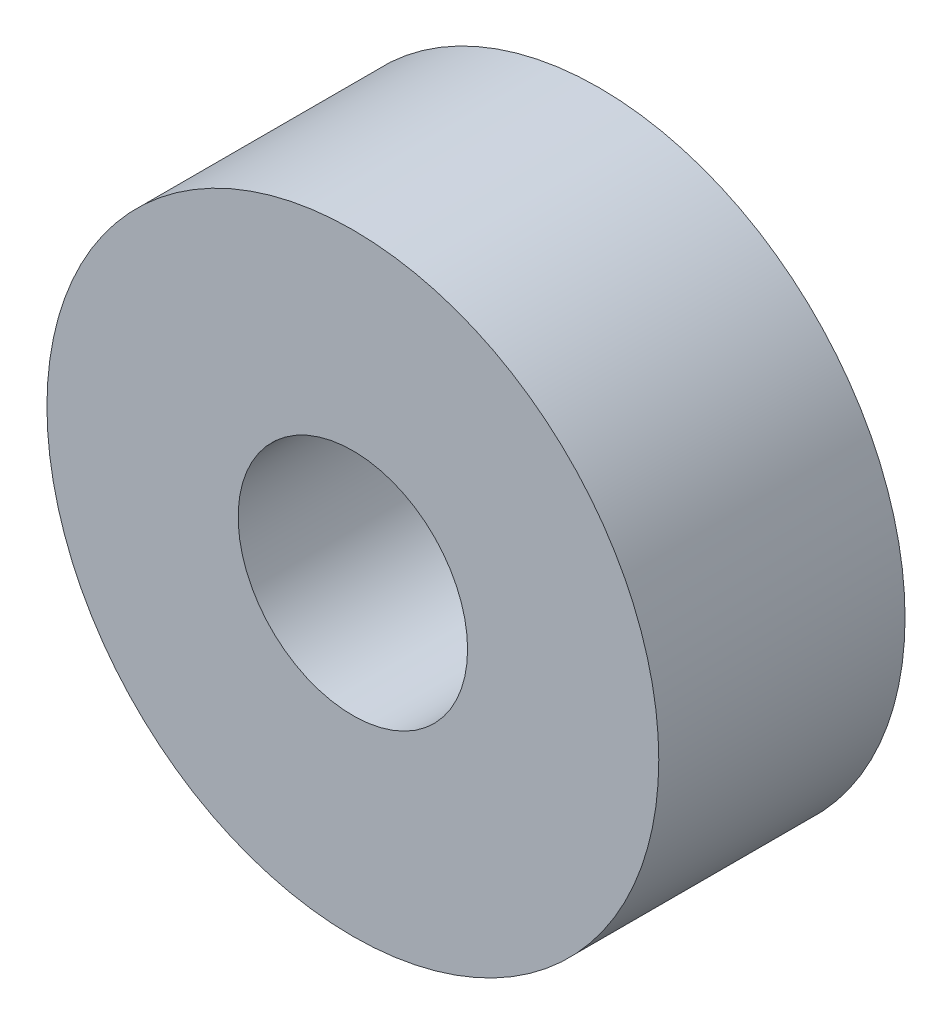
ISO-10303-21;
HEADER;
FILE_DESCRIPTION(('STEP AP214'),'2;1');
FILE_NAME('part.step','',(''),(''),'','','');
FILE_SCHEMA(('AUTOMOTIVE_DESIGN { 1 0 10303 214 1 1 1 1 }'));
ENDSEC;
DATA;
#1=APPLICATION_CONTEXT('core data for automotive mechanical design processes');
#2=APPLICATION_PROTOCOL_DEFINITION('international standard','automotive_design',2000,#1);
#3=PRODUCT_CONTEXT('',#1,'mechanical');
#4=PRODUCT('Part','Part','',(#3));
#5=PRODUCT_RELATED_PRODUCT_CATEGORY('part','',(#4));
#6=PRODUCT_DEFINITION_FORMATION('','',#4);
#7=PRODUCT_DEFINITION_CONTEXT('part definition',#1,'design');
#8=PRODUCT_DEFINITION('design','',#6,#7);
#9=PRODUCT_DEFINITION_SHAPE('','',#8);
#10=(LENGTH_UNIT() NAMED_UNIT(*) SI_UNIT(.MILLI.,.METRE.));
#11=(NAMED_UNIT(*) PLANE_ANGLE_UNIT() SI_UNIT($,.RADIAN.));
#12=(NAMED_UNIT(*) SI_UNIT($,.STERADIAN.) SOLID_ANGLE_UNIT());
#13=UNCERTAINTY_MEASURE_WITH_UNIT(LENGTH_MEASURE(1.E-05),#10,'distance_accuracy_value','');
#14=(GEOMETRIC_REPRESENTATION_CONTEXT(3) GLOBAL_UNCERTAINTY_ASSIGNED_CONTEXT((#13)) GLOBAL_UNIT_ASSIGNED_CONTEXT((#10,
#11,#12)) REPRESENTATION_CONTEXT('',''));
#15=CARTESIAN_POINT('',(0.,0.,0.));
#16=DIRECTION('',(0.,0.,1.));
#17=DIRECTION('',(1.,0.,0.));
#18=AXIS2_PLACEMENT_3D('',#15,#16,#17);
#19=CARTESIAN_POINT('',(0.,0.,1.61));
#20=DIRECTION('',(0.,0.,1.));
#21=DIRECTION('',(1.,0.,0.));
#22=AXIS2_PLACEMENT_3D('',#19,#20,#21);
#23=PLANE('',#22);
#24=CARTESIAN_POINT('',(0.,0.,1.61));
#25=DIRECTION('',(0.,0.,1.));
#26=DIRECTION('',(1.,0.,0.));
#27=AXIS2_PLACEMENT_3D('',#24,#25,#26);
#28=CIRCLE('',#27,4.);
#29=CARTESIAN_POINT('',(4.,0.,1.61));
#30=VERTEX_POINT('',#29);
#31=EDGE_CURVE('E10',#30,#30,#28,.T.);
#32=ORIENTED_EDGE('',*,*,#31,.T.);
#33=EDGE_LOOP('',(#32));
#34=FACE_BOUND('',#33,.T.);
#35=CARTESIAN_POINT('',(0.,0.,1.61));
#36=DIRECTION('',(0.,0.,1.));
#37=DIRECTION('',(1.,0.,0.));
#38=AXIS2_PLACEMENT_3D('',#35,#36,#37);
#39=CIRCLE('',#38,1.5);
#40=CARTESIAN_POINT('',(1.5,0.,1.61));
#41=VERTEX_POINT('',#40);
#42=EDGE_CURVE('E56',#41,#41,#39,.T.);
#43=ORIENTED_EDGE('',*,*,#42,.F.);
#44=EDGE_LOOP('',(#43));
#45=FACE_BOUND('',#44,.T.);
#46=ADVANCED_FACE('F43',(#34,#45),#23,.T.);
#47=CARTESIAN_POINT('',(0.,0.,-1.61));
#48=DIRECTION('',(0.,0.,1.));
#49=DIRECTION('',(1.,0.,0.));
#50=AXIS2_PLACEMENT_3D('',#47,#48,#49);
#51=PLANE('',#50);
#52=CARTESIAN_POINT('',(0.,0.,-1.61));
#53=DIRECTION('',(0.,0.,1.));
#54=DIRECTION('',(1.,0.,0.));
#55=AXIS2_PLACEMENT_3D('',#52,#53,#54);
#56=CIRCLE('',#55,4.);
#57=CARTESIAN_POINT('',(4.,0.,-1.61));
#58=VERTEX_POINT('',#57);
#59=EDGE_CURVE('E47',#58,#58,#56,.T.);
#60=ORIENTED_EDGE('',*,*,#59,.F.);
#61=EDGE_LOOP('',(#60));
#62=FACE_BOUND('',#61,.T.);
#63=CARTESIAN_POINT('',(0.,0.,-1.61));
#64=DIRECTION('',(0.,0.,1.));
#65=DIRECTION('',(1.,0.,0.));
#66=AXIS2_PLACEMENT_3D('',#63,#64,#65);
#67=CIRCLE('',#66,1.5);
#68=CARTESIAN_POINT('',(1.5,0.,-1.61));
#69=VERTEX_POINT('',#68);
#70=EDGE_CURVE('E58',#69,#69,#67,.T.);
#71=ORIENTED_EDGE('',*,*,#70,.T.);
#72=EDGE_LOOP('',(#71));
#73=FACE_BOUND('',#72,.T.);
#74=ADVANCED_FACE('F70',(#62,#73),#51,.F.);
#75=CARTESIAN_POINT('',(0.,0.,1.61));
#76=DIRECTION('',(0.,0.,-1.));
#77=DIRECTION('',(-1.,0.,0.));
#78=AXIS2_PLACEMENT_3D('',#75,#76,#77);
#79=CYLINDRICAL_SURFACE('',#78,4.);
#80=ORIENTED_EDGE('',*,*,#31,.F.);
#81=EDGE_LOOP('',(#80));
#82=FACE_BOUND('',#81,.T.);
#83=ORIENTED_EDGE('',*,*,#59,.T.);
#84=EDGE_LOOP('',(#83));
#85=FACE_BOUND('',#84,.T.);
#86=ADVANCED_FACE('F45',(#82,#85),#79,.T.);
#87=CARTESIAN_POINT('',(0.,0.,1.61));
#88=DIRECTION('',(0.,0.,-1.));
#89=DIRECTION('',(-1.,0.,0.));
#90=AXIS2_PLACEMENT_3D('',#87,#88,#89);
#91=CYLINDRICAL_SURFACE('',#90,1.5);
#92=ORIENTED_EDGE('',*,*,#42,.T.);
#93=EDGE_LOOP('',(#92));
#94=FACE_BOUND('',#93,.T.);
#95=ORIENTED_EDGE('',*,*,#70,.F.);
#96=EDGE_LOOP('',(#95));
#97=FACE_BOUND('',#96,.T.);
#98=ADVANCED_FACE('F66',(#94,#97),#91,.F.);
#99=CLOSED_SHELL('',(#46,#74,#86,#98));
#100=MANIFOLD_SOLID_BREP('B2',#99);
#101=ADVANCED_BREP_SHAPE_REPRESENTATION('',(#18,#100),#14);
#102=SHAPE_DEFINITION_REPRESENTATION(#9,#101);
ENDSEC;
END-ISO-10303-21;
